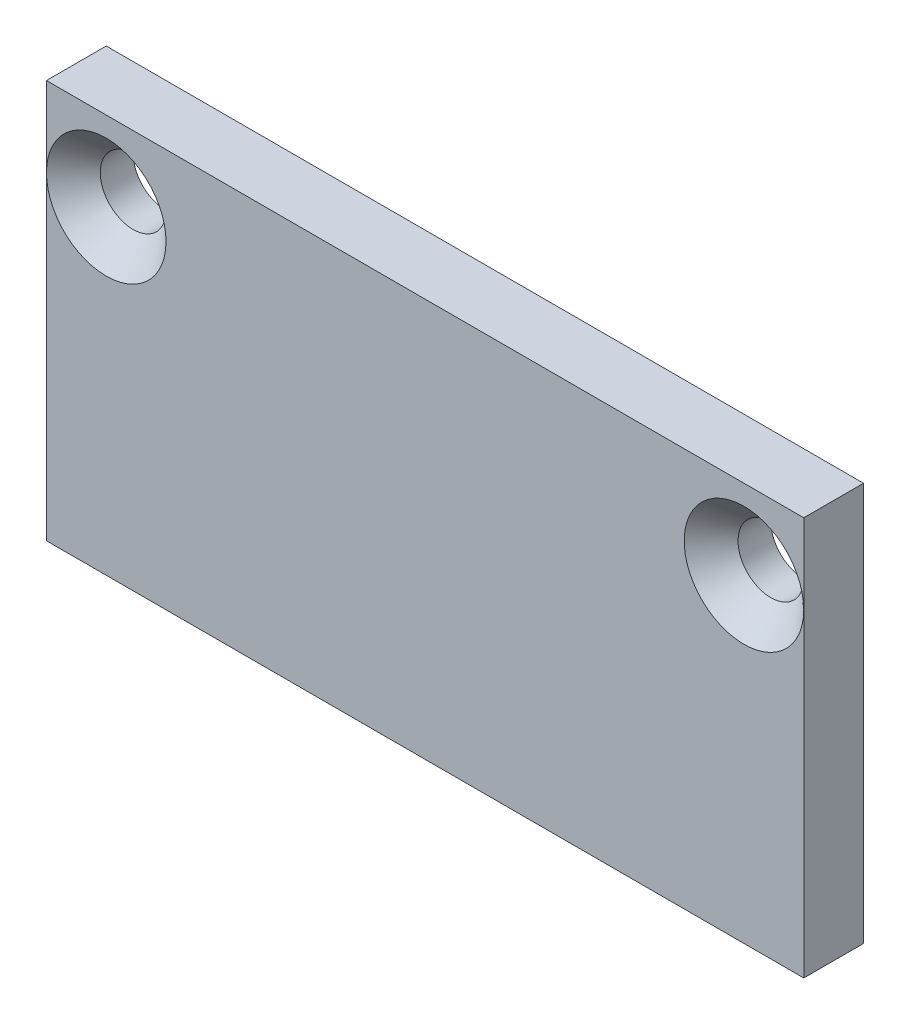
ISO-10303-21;
HEADER;
FILE_DESCRIPTION(('STEP AP214'),'2;1');
FILE_NAME('part.step','',(''),(''),'','','');
FILE_SCHEMA(('AUTOMOTIVE_DESIGN { 1 0 10303 214 1 1 1 1 }'));
ENDSEC;
DATA;
#1=APPLICATION_CONTEXT('core data for automotive mechanical design processes');
#2=APPLICATION_PROTOCOL_DEFINITION('international standard','automotive_design',2000,#1);
#3=PRODUCT_CONTEXT('',#1,'mechanical');
#4=PRODUCT('Part','Part','',(#3));
#5=PRODUCT_RELATED_PRODUCT_CATEGORY('part','',(#4));
#6=PRODUCT_DEFINITION_FORMATION('','',#4);
#7=PRODUCT_DEFINITION_CONTEXT('part definition',#1,'design');
#8=PRODUCT_DEFINITION('design','',#6,#7);
#9=PRODUCT_DEFINITION_SHAPE('','',#8);
#10=(LENGTH_UNIT() NAMED_UNIT(*) SI_UNIT(.MILLI.,.METRE.));
#11=(NAMED_UNIT(*) PLANE_ANGLE_UNIT() SI_UNIT($,.RADIAN.));
#12=(NAMED_UNIT(*) SI_UNIT($,.STERADIAN.) SOLID_ANGLE_UNIT());
#13=UNCERTAINTY_MEASURE_WITH_UNIT(LENGTH_MEASURE(1.E-05),#10,'distance_accuracy_value','');
#14=(GEOMETRIC_REPRESENTATION_CONTEXT(3) GLOBAL_UNCERTAINTY_ASSIGNED_CONTEXT((#13)) GLOBAL_UNIT_ASSIGNED_CONTEXT((#10,
#11,#12)) REPRESENTATION_CONTEXT('',''));
#15=CARTESIAN_POINT('',(0.,0.,0.));
#16=DIRECTION('',(0.,0.,1.));
#17=DIRECTION('',(1.,0.,0.));
#18=AXIS2_PLACEMENT_3D('',#15,#16,#17);
#19=CARTESIAN_POINT('',(-19.,0.,3.));
#20=DIRECTION('',(1.,0.,0.));
#21=DIRECTION('',(0.,0.,-1.));
#22=AXIS2_PLACEMENT_3D('',#19,#20,#21);
#23=PLANE('',#22);
#24=DIRECTION('',(0.,-1.,0.));
#25=VECTOR('',#24,1.);
#26=CARTESIAN_POINT('',(-19.,0.,0.));
#27=LINE('',#26,#25);
#28=CARTESIAN_POINT('',(-19.,20.,0.));
#29=VERTEX_POINT('',#28);
#30=CARTESIAN_POINT('',(-19.,0.,0.));
#31=VERTEX_POINT('',#30);
#32=EDGE_CURVE('E95',#29,#31,#27,.T.);
#33=ORIENTED_EDGE('',*,*,#32,.T.);
#34=DIRECTION('',(0.,0.,-1.));
#35=VECTOR('',#34,1.);
#36=CARTESIAN_POINT('',(-19.,0.,3.));
#37=LINE('',#36,#35);
#38=CARTESIAN_POINT('',(-19.,0.,3.));
#39=VERTEX_POINT('',#38);
#40=EDGE_CURVE('E11',#39,#31,#37,.T.);
#41=ORIENTED_EDGE('',*,*,#40,.F.);
#42=DIRECTION('',(0.,-1.,0.));
#43=VECTOR('',#42,1.);
#44=CARTESIAN_POINT('',(-19.,0.,3.));
#45=LINE('',#44,#43);
#46=CARTESIAN_POINT('',(-19.,16.,3.));
#47=VERTEX_POINT('',#46);
#48=EDGE_CURVE('E73',#47,#39,#45,.T.);
#49=ORIENTED_EDGE('',*,*,#48,.F.);
#50=CARTESIAN_POINT('',(-19.,20.,3.));
#51=VERTEX_POINT('',#50);
#52=EDGE_CURVE('E83',#51,#47,#45,.T.);
#53=ORIENTED_EDGE('',*,*,#52,.F.);
#54=DIRECTION('',(0.,0.,-1.));
#55=VECTOR('',#54,1.);
#56=CARTESIAN_POINT('',(-19.,20.,3.));
#57=LINE('',#56,#55);
#58=EDGE_CURVE('E97',#51,#29,#57,.T.);
#59=ORIENTED_EDGE('',*,*,#58,.T.);
#60=EDGE_LOOP('',(#33,#41,#49,#53,#59));
#61=FACE_BOUND('',#60,.T.);
#62=ADVANCED_FACE('F30',(#61),#23,.F.);
#63=CARTESIAN_POINT('',(-19.,0.,3.));
#64=DIRECTION('',(0.,1.,0.));
#65=DIRECTION('',(0.,0.,1.));
#66=AXIS2_PLACEMENT_3D('',#63,#64,#65);
#67=PLANE('',#66);
#68=DIRECTION('',(1.,0.,0.));
#69=VECTOR('',#68,1.);
#70=CARTESIAN_POINT('',(-19.,0.,0.));
#71=LINE('',#70,#69);
#72=CARTESIAN_POINT('',(19.,0.,0.));
#73=VERTEX_POINT('',#72);
#74=EDGE_CURVE('E100',#31,#73,#71,.T.);
#75=ORIENTED_EDGE('',*,*,#74,.T.);
#76=DIRECTION('',(0.,0.,-1.));
#77=VECTOR('',#76,1.);
#78=CARTESIAN_POINT('',(19.,0.,3.));
#79=LINE('',#78,#77);
#80=CARTESIAN_POINT('',(19.,0.,3.));
#81=VERTEX_POINT('',#80);
#82=EDGE_CURVE('E37',#81,#73,#79,.T.);
#83=ORIENTED_EDGE('',*,*,#82,.F.);
#84=DIRECTION('',(1.,0.,0.));
#85=VECTOR('',#84,1.);
#86=CARTESIAN_POINT('',(-19.,0.,3.));
#87=LINE('',#86,#85);
#88=EDGE_CURVE('E78',#39,#81,#87,.T.);
#89=ORIENTED_EDGE('',*,*,#88,.F.);
#90=ORIENTED_EDGE('',*,*,#40,.T.);
#91=EDGE_LOOP('',(#75,#83,#89,#90));
#92=FACE_BOUND('',#91,.T.);
#93=ADVANCED_FACE('F87',(#92),#67,.F.);
#94=CARTESIAN_POINT('',(19.,0.,3.));
#95=DIRECTION('',(-1.,0.,0.));
#96=DIRECTION('',(0.,0.,1.));
#97=AXIS2_PLACEMENT_3D('',#94,#95,#96);
#98=PLANE('',#97);
#99=DIRECTION('',(0.,1.,0.));
#100=VECTOR('',#99,1.);
#101=CARTESIAN_POINT('',(19.,0.,0.));
#102=LINE('',#101,#100);
#103=CARTESIAN_POINT('',(19.,20.,0.));
#104=VERTEX_POINT('',#103);
#105=EDGE_CURVE('E103',#73,#104,#102,.T.);
#106=ORIENTED_EDGE('',*,*,#105,.T.);
#107=DIRECTION('',(0.,0.,-1.));
#108=VECTOR('',#107,1.);
#109=CARTESIAN_POINT('',(19.,20.,3.));
#110=LINE('',#109,#108);
#111=CARTESIAN_POINT('',(19.,20.,3.));
#112=VERTEX_POINT('',#111);
#113=EDGE_CURVE('E115',#112,#104,#110,.T.);
#114=ORIENTED_EDGE('',*,*,#113,.F.);
#115=DIRECTION('',(0.,1.,0.));
#116=VECTOR('',#115,1.);
#117=CARTESIAN_POINT('',(19.,0.,3.));
#118=LINE('',#117,#116);
#119=CARTESIAN_POINT('',(19.,16.,3.));
#120=VERTEX_POINT('',#119);
#121=EDGE_CURVE('E91',#120,#112,#118,.T.);
#122=ORIENTED_EDGE('',*,*,#121,.F.);
#123=EDGE_CURVE('E122',#81,#120,#118,.T.);
#124=ORIENTED_EDGE('',*,*,#123,.F.);
#125=ORIENTED_EDGE('',*,*,#82,.T.);
#126=EDGE_LOOP('',(#106,#114,#122,#124,#125));
#127=FACE_BOUND('',#126,.T.);
#128=ADVANCED_FACE('F119',(#127),#98,.F.);
#129=CARTESIAN_POINT('',(-19.,20.,3.));
#130=DIRECTION('',(0.,-1.,0.));
#131=DIRECTION('',(0.,0.,-1.));
#132=AXIS2_PLACEMENT_3D('',#129,#130,#131);
#133=PLANE('',#132);
#134=DIRECTION('',(-1.,0.,0.));
#135=VECTOR('',#134,1.);
#136=CARTESIAN_POINT('',(-19.,20.,0.));
#137=LINE('',#136,#135);
#138=EDGE_CURVE('E84',#104,#29,#137,.T.);
#139=ORIENTED_EDGE('',*,*,#138,.T.);
#140=ORIENTED_EDGE('',*,*,#58,.F.);
#141=DIRECTION('',(-1.,0.,0.));
#142=VECTOR('',#141,1.);
#143=CARTESIAN_POINT('',(-19.,20.,3.));
#144=LINE('',#143,#142);
#145=EDGE_CURVE('E109',#112,#51,#144,.T.);
#146=ORIENTED_EDGE('',*,*,#145,.F.);
#147=ORIENTED_EDGE('',*,*,#113,.T.);
#148=EDGE_LOOP('',(#139,#140,#146,#147));
#149=FACE_BOUND('',#148,.T.);
#150=ADVANCED_FACE('F125',(#149),#133,.F.);
#151=CARTESIAN_POINT('',(-19.,20.,3.));
#152=DIRECTION('',(0.,0.,-1.));
#153=DIRECTION('',(-1.,0.,0.));
#154=AXIS2_PLACEMENT_3D('',#151,#152,#153);
#155=PLANE('',#154);
#156=ORIENTED_EDGE('',*,*,#52,.T.);
#157=CARTESIAN_POINT('',(-16.,16.,3.));
#158=DIRECTION('',(0.,0.,1.));
#159=DIRECTION('',(1.,0.,0.));
#160=AXIS2_PLACEMENT_3D('',#157,#158,#159);
#161=CIRCLE('',#160,3.);
#162=EDGE_CURVE('E42',#47,#47,#161,.T.);
#163=ORIENTED_EDGE('',*,*,#162,.F.);
#164=ORIENTED_EDGE('',*,*,#48,.T.);
#165=ORIENTED_EDGE('',*,*,#88,.T.);
#166=ORIENTED_EDGE('',*,*,#123,.T.);
#167=CARTESIAN_POINT('',(16.,16.,3.));
#168=DIRECTION('',(0.,0.,1.));
#169=DIRECTION('',(1.,0.,0.));
#170=AXIS2_PLACEMENT_3D('',#167,#168,#169);
#171=CIRCLE('',#170,3.);
#172=EDGE_CURVE('E47',#120,#120,#171,.T.);
#173=ORIENTED_EDGE('',*,*,#172,.F.);
#174=ORIENTED_EDGE('',*,*,#121,.T.);
#175=ORIENTED_EDGE('',*,*,#145,.T.);
#176=EDGE_LOOP('',(#156,#163,#164,#165,#166,#173,#174,#175));
#177=FACE_BOUND('',#176,.T.);
#178=ADVANCED_FACE('F76',(#177),#155,.F.);
#179=CARTESIAN_POINT('',(-19.,20.,0.));
#180=DIRECTION('',(0.,0.,-1.));
#181=DIRECTION('',(-1.,0.,0.));
#182=AXIS2_PLACEMENT_3D('',#179,#180,#181);
#183=PLANE('',#182);
#184=CARTESIAN_POINT('',(-16.,16.,0.));
#185=DIRECTION('',(0.,0.,1.));
#186=DIRECTION('',(1.,0.,0.));
#187=AXIS2_PLACEMENT_3D('',#184,#185,#186);
#188=CIRCLE('',#187,1.65);
#189=CARTESIAN_POINT('',(-14.35,16.,0.));
#190=VERTEX_POINT('',#189);
#191=EDGE_CURVE('E131',#190,#190,#188,.T.);
#192=ORIENTED_EDGE('',*,*,#191,.T.);
#193=EDGE_LOOP('',(#192));
#194=FACE_BOUND('',#193,.T.);
#195=CARTESIAN_POINT('',(16.,16.,0.));
#196=DIRECTION('',(0.,0.,1.));
#197=DIRECTION('',(1.,0.,0.));
#198=AXIS2_PLACEMENT_3D('',#195,#196,#197);
#199=CIRCLE('',#198,1.65);
#200=CARTESIAN_POINT('',(17.65,16.,0.));
#201=VERTEX_POINT('',#200);
#202=EDGE_CURVE('E101',#201,#201,#199,.T.);
#203=ORIENTED_EDGE('',*,*,#202,.T.);
#204=EDGE_LOOP('',(#203));
#205=FACE_BOUND('',#204,.T.);
#206=ORIENTED_EDGE('',*,*,#32,.F.);
#207=ORIENTED_EDGE('',*,*,#138,.F.);
#208=ORIENTED_EDGE('',*,*,#105,.F.);
#209=ORIENTED_EDGE('',*,*,#74,.F.);
#210=EDGE_LOOP('',(#206,#207,#208,#209));
#211=FACE_BOUND('',#210,.T.);
#212=ADVANCED_FACE('F123',(#194,#205,#211),#183,.T.);
#213=CARTESIAN_POINT('',(16.,16.,3.));
#214=DIRECTION('',(0.,0.,1.));
#215=DIRECTION('',(1.,0.,0.));
#216=AXIS2_PLACEMENT_3D('',#213,#214,#215);
#217=CYLINDRICAL_SURFACE('',#216,1.65);
#218=ORIENTED_EDGE('',*,*,#202,.F.);
#219=EDGE_LOOP('',(#218));
#220=FACE_BOUND('',#219,.T.);
#221=CARTESIAN_POINT('',(16.,16.,1.65));
#222=DIRECTION('',(0.,0.,1.));
#223=DIRECTION('',(1.,0.,0.));
#224=AXIS2_PLACEMENT_3D('',#221,#222,#223);
#225=CIRCLE('',#224,1.65);
#226=CARTESIAN_POINT('',(17.65,16.,1.65));
#227=VERTEX_POINT('',#226);
#228=EDGE_CURVE('E106',#227,#227,#225,.T.);
#229=ORIENTED_EDGE('',*,*,#228,.T.);
#230=EDGE_LOOP('',(#229));
#231=FACE_BOUND('',#230,.T.);
#232=ADVANCED_FACE('F163',(#220,#231),#217,.F.);
#233=CARTESIAN_POINT('',(16.,16.,3.));
#234=DIRECTION('',(0.,0.,1.));
#235=DIRECTION('',(1.,0.,0.));
#236=AXIS2_PLACEMENT_3D('',#233,#234,#235);
#237=CONICAL_SURFACE('',#236,3.,0.785398163397448);
#238=ORIENTED_EDGE('',*,*,#228,.F.);
#239=EDGE_LOOP('',(#238));
#240=FACE_BOUND('',#239,.T.);
#241=ORIENTED_EDGE('',*,*,#172,.T.);
#242=EDGE_LOOP('',(#241));
#243=FACE_BOUND('',#242,.T.);
#244=ADVANCED_FACE('F147',(#240,#243),#237,.F.);
#245=CARTESIAN_POINT('',(-16.,16.,3.));
#246=DIRECTION('',(0.,0.,1.));
#247=DIRECTION('',(1.,0.,0.));
#248=AXIS2_PLACEMENT_3D('',#245,#246,#247);
#249=CYLINDRICAL_SURFACE('',#248,1.65);
#250=ORIENTED_EDGE('',*,*,#191,.F.);
#251=EDGE_LOOP('',(#250));
#252=FACE_BOUND('',#251,.T.);
#253=CARTESIAN_POINT('',(-16.,16.,1.65));
#254=DIRECTION('',(0.,0.,1.));
#255=DIRECTION('',(1.,0.,0.));
#256=AXIS2_PLACEMENT_3D('',#253,#254,#255);
#257=CIRCLE('',#256,1.65);
#258=CARTESIAN_POINT('',(-14.35,16.,1.65));
#259=VERTEX_POINT('',#258);
#260=EDGE_CURVE('E134',#259,#259,#257,.T.);
#261=ORIENTED_EDGE('',*,*,#260,.T.);
#262=EDGE_LOOP('',(#261));
#263=FACE_BOUND('',#262,.T.);
#264=ADVANCED_FACE('F139',(#252,#263),#249,.F.);
#265=CARTESIAN_POINT('',(-16.,16.,3.));
#266=DIRECTION('',(0.,0.,1.));
#267=DIRECTION('',(1.,0.,0.));
#268=AXIS2_PLACEMENT_3D('',#265,#266,#267);
#269=CONICAL_SURFACE('',#268,3.,0.785398163397448);
#270=ORIENTED_EDGE('',*,*,#260,.F.);
#271=EDGE_LOOP('',(#270));
#272=FACE_BOUND('',#271,.T.);
#273=ORIENTED_EDGE('',*,*,#162,.T.);
#274=EDGE_LOOP('',(#273));
#275=FACE_BOUND('',#274,.T.);
#276=ADVANCED_FACE('F141',(#272,#275),#269,.F.);
#277=CLOSED_SHELL('',(#62,#93,#128,#150,#178,#212,#232,#244,#264,#276));
#278=MANIFOLD_SOLID_BREP('B2',#277);
#279=ADVANCED_BREP_SHAPE_REPRESENTATION('',(#18,#278),#14);
#280=SHAPE_DEFINITION_REPRESENTATION(#9,#279);
ENDSEC;
END-ISO-10303-21;
